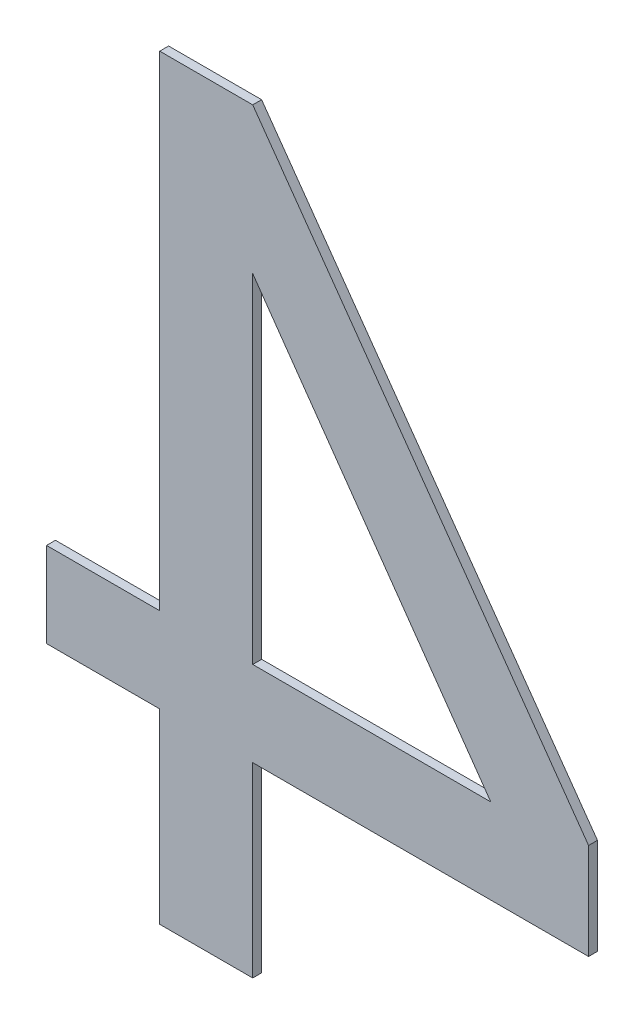
ISO-10303-21;
HEADER;
FILE_DESCRIPTION(('STEP AP214'),'2;1');
FILE_NAME('part.step','',(''),(''),'','','');
FILE_SCHEMA(('AUTOMOTIVE_DESIGN { 1 0 10303 214 1 1 1 1 }'));
ENDSEC;
DATA;
#1=APPLICATION_CONTEXT('core data for automotive mechanical design processes');
#2=APPLICATION_PROTOCOL_DEFINITION('international standard','automotive_design',2000,#1);
#3=PRODUCT_CONTEXT('',#1,'mechanical');
#4=PRODUCT('Part','Part','',(#3));
#5=PRODUCT_RELATED_PRODUCT_CATEGORY('part','',(#4));
#6=PRODUCT_DEFINITION_FORMATION('','',#4);
#7=PRODUCT_DEFINITION_CONTEXT('part definition',#1,'design');
#8=PRODUCT_DEFINITION('design','',#6,#7);
#9=PRODUCT_DEFINITION_SHAPE('','',#8);
#10=(LENGTH_UNIT() NAMED_UNIT(*) SI_UNIT(.MILLI.,.METRE.));
#11=(NAMED_UNIT(*) PLANE_ANGLE_UNIT() SI_UNIT($,.RADIAN.));
#12=(NAMED_UNIT(*) SI_UNIT($,.STERADIAN.) SOLID_ANGLE_UNIT());
#13=UNCERTAINTY_MEASURE_WITH_UNIT(LENGTH_MEASURE(1.E-05),#10,'distance_accuracy_value','');
#14=(GEOMETRIC_REPRESENTATION_CONTEXT(3) GLOBAL_UNCERTAINTY_ASSIGNED_CONTEXT((#13)) GLOBAL_UNIT_ASSIGNED_CONTEXT((#10,
#11,#12)) REPRESENTATION_CONTEXT('',''));
#15=CARTESIAN_POINT('',(0.,0.,0.));
#16=DIRECTION('',(0.,0.,1.));
#17=DIRECTION('',(1.,0.,0.));
#18=AXIS2_PLACEMENT_3D('',#15,#16,#17);
#19=CARTESIAN_POINT('',(0.459574876566214,1.8244100426255,-3.53695));
#20=DIRECTION('',(0.,0.,1.));
#21=DIRECTION('',(1.,0.,0.));
#22=AXIS2_PLACEMENT_3D('',#19,#20,#21);
#23=PLANE('',#22);
#24=DIRECTION('',(-0.57527075867692,0.817963051861929,0.));
#25=VECTOR('',#24,1.);
#26=CARTESIAN_POINT('',(0.49826978474495,1.86917473544442,-3.53695));
#27=LINE('',#26,#25);
#28=CARTESIAN_POINT('',(0.583246842571535,1.74834798993431,-3.53695));
#29=VERTEX_POINT('',#28);
#30=CARTESIAN_POINT('',(0.413292726918359,1.99000148095454,-3.53695));
#31=VERTEX_POINT('',#30);
#32=EDGE_CURVE('E176',#29,#31,#27,.T.);
#33=ORIENTED_EDGE('',*,*,#32,.T.);
#34=DIRECTION('',(0.,1.,0.));
#35=VECTOR('',#34,1.);
#36=CARTESIAN_POINT('',(0.413292726918354,1.86917473544442,-3.53695));
#37=LINE('',#36,#35);
#38=CARTESIAN_POINT('',(0.413292726918354,1.74834798993431,-3.53695));
#39=VERTEX_POINT('',#38);
#40=EDGE_CURVE('E184',#39,#31,#37,.T.);
#41=ORIENTED_EDGE('',*,*,#40,.F.);
#42=DIRECTION('',(1.,0.,0.));
#43=VECTOR('',#42,1.);
#44=CARTESIAN_POINT('',(0.49826978474495,1.74834798993431,-3.53695));
#45=LINE('',#44,#43);
#46=EDGE_CURVE('E181',#29,#39,#45,.F.);
#47=ORIENTED_EDGE('',*,*,#46,.F.);
#48=EDGE_LOOP('',(#33,#41,#47));
#49=FACE_BOUND('',#48,.T.);
#50=DIRECTION('',(1.,0.,0.));
#51=VECTOR('',#50,1.);
#52=CARTESIAN_POINT('',(0.533171073229762,1.68765009148682,-3.53695));
#53=LINE('',#52,#51);
#54=CARTESIAN_POINT('',(0.653049419540916,1.68765009148682,-3.53695));
#55=VERTEX_POINT('',#54);
#56=CARTESIAN_POINT('',(0.413292726918354,1.68765009148682,-3.53695));
#57=VERTEX_POINT('',#56);
#58=EDGE_CURVE('E161',#55,#57,#53,.F.);
#59=ORIENTED_EDGE('',*,*,#58,.T.);
#60=DIRECTION('',(0.,1.,0.));
#61=VECTOR('',#60,1.);
#62=CARTESIAN_POINT('',(0.413292726918354,1.62107208698955,-3.53695));
#63=LINE('',#62,#61);
#64=CARTESIAN_POINT('',(0.413292726918354,1.55449408249228,-3.53695));
#65=VERTEX_POINT('',#64);
#66=EDGE_CURVE('E158',#65,#57,#63,.T.);
#67=ORIENTED_EDGE('',*,*,#66,.F.);
#68=DIRECTION('',(1.,0.,0.));
#69=VECTOR('',#68,1.);
#70=CARTESIAN_POINT('',(0.380098562403844,1.55449408249228,-3.53695));
#71=LINE('',#70,#69);
#72=CARTESIAN_POINT('',(0.346904397889334,1.55449408249228,-3.53695));
#73=VERTEX_POINT('',#72);
#74=EDGE_CURVE('E151',#65,#73,#71,.F.);
#75=ORIENTED_EDGE('',*,*,#74,.T.);
#76=DIRECTION('',(0.,1.,0.));
#77=VECTOR('',#76,1.);
#78=CARTESIAN_POINT('',(0.346904397889334,1.62107208698955,-3.53695));
#79=LINE('',#78,#77);
#80=CARTESIAN_POINT('',(0.346904397889334,1.68765009148682,-3.53695));
#81=VERTEX_POINT('',#80);
#82=EDGE_CURVE('E147',#73,#81,#79,.T.);
#83=ORIENTED_EDGE('',*,*,#82,.T.);
#84=DIRECTION('',(1.,0.,0.));
#85=VECTOR('',#84,1.);
#86=CARTESIAN_POINT('',(0.306502365740296,1.68765009148682,-3.53695));
#87=LINE('',#86,#85);
#88=CARTESIAN_POINT('',(0.266100333591512,1.68765009148682,-3.53695));
#89=VERTEX_POINT('',#88);
#90=EDGE_CURVE('E143',#81,#89,#87,.F.);
#91=ORIENTED_EDGE('',*,*,#90,.T.);
#92=DIRECTION('',(0.,1.,0.));
#93=VECTOR('',#92,1.);
#94=CARTESIAN_POINT('',(0.266100333591512,1.71799904071057,-3.53695));
#95=LINE('',#94,#93);
#96=CARTESIAN_POINT('',(0.266100333591512,1.74834798993431,-3.53695));
#97=VERTEX_POINT('',#96);
#98=EDGE_CURVE('E139',#89,#97,#95,.T.);
#99=ORIENTED_EDGE('',*,*,#98,.T.);
#100=DIRECTION('',(1.,0.,0.));
#101=VECTOR('',#100,1.);
#102=CARTESIAN_POINT('',(0.306502365740296,1.74834798993431,-3.53695));
#103=LINE('',#102,#101);
#104=CARTESIAN_POINT('',(0.346904397889334,1.74834798993431,-3.53695));
#105=VERTEX_POINT('',#104);
#106=EDGE_CURVE('E121',#105,#97,#103,.F.);
#107=ORIENTED_EDGE('',*,*,#106,.F.);
#108=DIRECTION('',(0.,1.,0.));
#109=VECTOR('',#108,1.);
#110=CARTESIAN_POINT('',(0.346904397889334,1.92133699634626,-3.53695));
#111=LINE('',#110,#109);
#112=CARTESIAN_POINT('',(0.346904397889334,2.09432600275846,-3.53695));
#113=VERTEX_POINT('',#112);
#114=EDGE_CURVE('E114',#105,#113,#111,.T.);
#115=ORIENTED_EDGE('',*,*,#114,.T.);
#116=DIRECTION('',(1.,0.,0.));
#117=VECTOR('',#116,1.);
#118=CARTESIAN_POINT('',(0.380098562403844,2.09432600275846,-3.53695));
#119=LINE('',#118,#117);
#120=CARTESIAN_POINT('',(0.413292726918371,2.09432600275848,-3.53695));
#121=VERTEX_POINT('',#120);
#122=EDGE_CURVE('E19',#121,#113,#119,.F.);
#123=ORIENTED_EDGE('',*,*,#122,.F.);
#124=DIRECTION('',(-0.578550603330596,0.815646491677494,0.));
#125=VECTOR('',#124,1.);
#126=CARTESIAN_POINT('',(0.533171073229762,1.92532029775353,-3.53695));
#127=LINE('',#126,#125);
#128=CARTESIAN_POINT('',(0.653049419540941,1.75631459274862,-3.53695));
#129=VERTEX_POINT('',#128);
#130=EDGE_CURVE('E173',#129,#121,#127,.T.);
#131=ORIENTED_EDGE('',*,*,#130,.F.);
#132=DIRECTION('',(0.,1.,0.));
#133=VECTOR('',#132,1.);
#134=CARTESIAN_POINT('',(0.653049419540916,1.72198234211758,-3.53695));
#135=LINE('',#134,#133);
#136=EDGE_CURVE('E168',#55,#129,#135,.T.);
#137=ORIENTED_EDGE('',*,*,#136,.F.);
#138=EDGE_LOOP('',(#59,#67,#75,#83,#91,#99,#107,#115,#123,#131,#137));
#139=FACE_BOUND('',#138,.T.);
#140=ADVANCED_FACE('F16',(#49,#139),#23,.F.);
#141=CARTESIAN_POINT('',(0.380098562403844,2.09432600275846,-3.533775));
#142=DIRECTION('',(0.,1.,0.));
#143=DIRECTION('',(0.,0.,1.));
#144=AXIS2_PLACEMENT_3D('',#141,#142,#143);
#145=PLANE('',#144);
#146=DIRECTION('',(0.,0.,-1.));
#147=VECTOR('',#146,1.);
#148=CARTESIAN_POINT('',(0.346904397889334,2.09432600275846,-3.533775));
#149=LINE('',#148,#147);
#150=CARTESIAN_POINT('',(0.346904397889334,2.09432600275846,-3.5306));
#151=VERTEX_POINT('',#150);
#152=EDGE_CURVE('E123',#113,#151,#149,.F.);
#153=ORIENTED_EDGE('',*,*,#152,.T.);
#154=DIRECTION('',(1.,0.,0.));
#155=VECTOR('',#154,1.);
#156=CARTESIAN_POINT('',(0.459574876566214,2.09432600275846,-3.5306));
#157=LINE('',#156,#155);
#158=CARTESIAN_POINT('',(0.413292726918371,2.09432600275848,-3.5306));
#159=VERTEX_POINT('',#158);
#160=EDGE_CURVE('E190',#159,#151,#157,.F.);
#161=ORIENTED_EDGE('',*,*,#160,.F.);
#162=DIRECTION('',(0.,0.,1.));
#163=VECTOR('',#162,1.);
#164=CARTESIAN_POINT('',(0.413292726918422,2.09432600275851,-3.533775));
#165=LINE('',#164,#163);
#166=EDGE_CURVE('E128',#121,#159,#165,.T.);
#167=ORIENTED_EDGE('',*,*,#166,.F.);
#168=ORIENTED_EDGE('',*,*,#122,.T.);
#169=EDGE_LOOP('',(#153,#161,#167,#168));
#170=FACE_BOUND('',#169,.T.);
#171=ADVANCED_FACE('F125',(#170),#145,.T.);
#172=CARTESIAN_POINT('',(0.346904397889334,1.92133699634626,-3.533775));
#173=DIRECTION('',(1.,0.,0.));
#174=DIRECTION('',(0.,0.,-1.));
#175=AXIS2_PLACEMENT_3D('',#172,#173,#174);
#176=PLANE('',#175);
#177=ORIENTED_EDGE('',*,*,#114,.F.);
#178=DIRECTION('',(0.,0.,1.));
#179=VECTOR('',#178,1.);
#180=CARTESIAN_POINT('',(0.346904397889334,1.74834798993431,-3.533775));
#181=LINE('',#180,#179);
#182=CARTESIAN_POINT('',(0.346904397889334,1.74834798993431,-3.5306));
#183=VERTEX_POINT('',#182);
#184=EDGE_CURVE('E134',#183,#105,#181,.F.);
#185=ORIENTED_EDGE('',*,*,#184,.F.);
#186=DIRECTION('',(0.,1.,0.));
#187=VECTOR('',#186,1.);
#188=CARTESIAN_POINT('',(0.346904397889334,1.8244100426255,-3.5306));
#189=LINE('',#188,#187);
#190=EDGE_CURVE('E132',#151,#183,#189,.F.);
#191=ORIENTED_EDGE('',*,*,#190,.F.);
#192=ORIENTED_EDGE('',*,*,#152,.F.);
#193=EDGE_LOOP('',(#177,#185,#191,#192));
#194=FACE_BOUND('',#193,.T.);
#195=ADVANCED_FACE('F130',(#194),#176,.F.);
#196=CARTESIAN_POINT('',(0.306502365740296,1.74834798993431,-3.533775));
#197=DIRECTION('',(0.,1.,0.));
#198=DIRECTION('',(0.,0.,1.));
#199=AXIS2_PLACEMENT_3D('',#196,#197,#198);
#200=PLANE('',#199);
#201=DIRECTION('',(0.,0.,-1.));
#202=VECTOR('',#201,1.);
#203=CARTESIAN_POINT('',(0.266100333591512,1.74834798993431,-3.533775));
#204=LINE('',#203,#202);
#205=CARTESIAN_POINT('',(0.266100333591512,1.74834798993431,-3.5306));
#206=VERTEX_POINT('',#205);
#207=EDGE_CURVE('E141',#97,#206,#204,.F.);
#208=ORIENTED_EDGE('',*,*,#207,.T.);
#209=DIRECTION('',(1.,0.,0.));
#210=VECTOR('',#209,1.);
#211=CARTESIAN_POINT('',(0.459574876566214,1.74834798993431,-3.5306));
#212=LINE('',#211,#210);
#213=EDGE_CURVE('E193',#183,#206,#212,.F.);
#214=ORIENTED_EDGE('',*,*,#213,.F.);
#215=ORIENTED_EDGE('',*,*,#184,.T.);
#216=ORIENTED_EDGE('',*,*,#106,.T.);
#217=EDGE_LOOP('',(#208,#214,#215,#216));
#218=FACE_BOUND('',#217,.T.);
#219=ADVANCED_FACE('F279',(#218),#200,.T.);
#220=CARTESIAN_POINT('',(0.266100333591512,1.71799904071057,-3.533775));
#221=DIRECTION('',(1.,0.,0.));
#222=DIRECTION('',(0.,0.,-1.));
#223=AXIS2_PLACEMENT_3D('',#220,#221,#222);
#224=PLANE('',#223);
#225=ORIENTED_EDGE('',*,*,#98,.F.);
#226=DIRECTION('',(0.,0.,1.));
#227=VECTOR('',#226,1.);
#228=CARTESIAN_POINT('',(0.266100333591512,1.68765009148682,-3.533775));
#229=LINE('',#228,#227);
#230=CARTESIAN_POINT('',(0.266100333591512,1.68765009148682,-3.5306));
#231=VERTEX_POINT('',#230);
#232=EDGE_CURVE('E145',#89,#231,#229,.T.);
#233=ORIENTED_EDGE('',*,*,#232,.T.);
#234=DIRECTION('',(0.,1.,0.));
#235=VECTOR('',#234,1.);
#236=CARTESIAN_POINT('',(0.266100333591512,1.8244100426255,-3.5306));
#237=LINE('',#236,#235);
#238=EDGE_CURVE('E196',#206,#231,#237,.F.);
#239=ORIENTED_EDGE('',*,*,#238,.F.);
#240=ORIENTED_EDGE('',*,*,#207,.F.);
#241=EDGE_LOOP('',(#225,#233,#239,#240));
#242=FACE_BOUND('',#241,.T.);
#243=ADVANCED_FACE('F275',(#242),#224,.F.);
#244=CARTESIAN_POINT('',(0.306502365740296,1.68765009148682,-3.533775));
#245=DIRECTION('',(0.,1.,0.));
#246=DIRECTION('',(0.,0.,1.));
#247=AXIS2_PLACEMENT_3D('',#244,#245,#246);
#248=PLANE('',#247);
#249=ORIENTED_EDGE('',*,*,#90,.F.);
#250=DIRECTION('',(0.,0.,-1.));
#251=VECTOR('',#250,1.);
#252=CARTESIAN_POINT('',(0.346904397889334,1.68765009148682,-3.533775));
#253=LINE('',#252,#251);
#254=CARTESIAN_POINT('',(0.346904397889334,1.68765009148682,-3.5306));
#255=VERTEX_POINT('',#254);
#256=EDGE_CURVE('E149',#81,#255,#253,.F.);
#257=ORIENTED_EDGE('',*,*,#256,.T.);
#258=DIRECTION('',(1.,0.,0.));
#259=VECTOR('',#258,1.);
#260=CARTESIAN_POINT('',(0.459574876566214,1.68765009148682,-3.5306));
#261=LINE('',#260,#259);
#262=EDGE_CURVE('E199',#231,#255,#261,.T.);
#263=ORIENTED_EDGE('',*,*,#262,.F.);
#264=ORIENTED_EDGE('',*,*,#232,.F.);
#265=EDGE_LOOP('',(#249,#257,#263,#264));
#266=FACE_BOUND('',#265,.T.);
#267=ADVANCED_FACE('F271',(#266),#248,.F.);
#268=CARTESIAN_POINT('',(0.346904397889334,1.62107208698955,-3.533775));
#269=DIRECTION('',(1.,0.,0.));
#270=DIRECTION('',(0.,0.,-1.));
#271=AXIS2_PLACEMENT_3D('',#268,#269,#270);
#272=PLANE('',#271);
#273=ORIENTED_EDGE('',*,*,#82,.F.);
#274=DIRECTION('',(0.,0.,1.));
#275=VECTOR('',#274,1.);
#276=CARTESIAN_POINT('',(0.346904397889334,1.55449408249228,-3.533775));
#277=LINE('',#276,#275);
#278=CARTESIAN_POINT('',(0.346904397889334,1.55449408249228,-3.5306));
#279=VERTEX_POINT('',#278);
#280=EDGE_CURVE('E153',#73,#279,#277,.T.);
#281=ORIENTED_EDGE('',*,*,#280,.T.);
#282=DIRECTION('',(0.,1.,0.));
#283=VECTOR('',#282,1.);
#284=CARTESIAN_POINT('',(0.346904397889334,1.8244100426255,-3.5306));
#285=LINE('',#284,#283);
#286=EDGE_CURVE('E202',#255,#279,#285,.F.);
#287=ORIENTED_EDGE('',*,*,#286,.F.);
#288=ORIENTED_EDGE('',*,*,#256,.F.);
#289=EDGE_LOOP('',(#273,#281,#287,#288));
#290=FACE_BOUND('',#289,.T.);
#291=ADVANCED_FACE('F267',(#290),#272,.F.);
#292=CARTESIAN_POINT('',(0.380098562403844,1.55449408249228,-3.533775));
#293=DIRECTION('',(0.,1.,0.));
#294=DIRECTION('',(0.,0.,1.));
#295=AXIS2_PLACEMENT_3D('',#292,#293,#294);
#296=PLANE('',#295);
#297=ORIENTED_EDGE('',*,*,#74,.F.);
#298=DIRECTION('',(0.,0.,-1.));
#299=VECTOR('',#298,1.);
#300=CARTESIAN_POINT('',(0.413292726918354,1.55449408249228,-3.533775));
#301=LINE('',#300,#299);
#302=CARTESIAN_POINT('',(0.413292726918354,1.55449408249228,-3.5306));
#303=VERTEX_POINT('',#302);
#304=EDGE_CURVE('E155',#303,#65,#301,.T.);
#305=ORIENTED_EDGE('',*,*,#304,.F.);
#306=DIRECTION('',(1.,0.,0.));
#307=VECTOR('',#306,1.);
#308=CARTESIAN_POINT('',(0.459574876566214,1.55449408249228,-3.5306));
#309=LINE('',#308,#307);
#310=EDGE_CURVE('E205',#279,#303,#309,.T.);
#311=ORIENTED_EDGE('',*,*,#310,.F.);
#312=ORIENTED_EDGE('',*,*,#280,.F.);
#313=EDGE_LOOP('',(#297,#305,#311,#312));
#314=FACE_BOUND('',#313,.T.);
#315=ADVANCED_FACE('F263',(#314),#296,.F.);
#316=CARTESIAN_POINT('',(0.413292726918354,1.62107208698955,-3.533775));
#317=DIRECTION('',(1.,0.,0.));
#318=DIRECTION('',(0.,0.,-1.));
#319=AXIS2_PLACEMENT_3D('',#316,#317,#318);
#320=PLANE('',#319);
#321=DIRECTION('',(0.,0.,1.));
#322=VECTOR('',#321,1.);
#323=CARTESIAN_POINT('',(0.413292726918354,1.68765009148682,-3.533775));
#324=LINE('',#323,#322);
#325=CARTESIAN_POINT('',(0.413292726918354,1.68765009148682,-3.5306));
#326=VERTEX_POINT('',#325);
#327=EDGE_CURVE('E163',#57,#326,#324,.T.);
#328=ORIENTED_EDGE('',*,*,#327,.T.);
#329=DIRECTION('',(0.,1.,0.));
#330=VECTOR('',#329,1.);
#331=CARTESIAN_POINT('',(0.413292726918354,1.8244100426255,-3.5306));
#332=LINE('',#331,#330);
#333=EDGE_CURVE('E208',#303,#326,#332,.T.);
#334=ORIENTED_EDGE('',*,*,#333,.F.);
#335=ORIENTED_EDGE('',*,*,#304,.T.);
#336=ORIENTED_EDGE('',*,*,#66,.T.);
#337=EDGE_LOOP('',(#328,#334,#335,#336));
#338=FACE_BOUND('',#337,.T.);
#339=ADVANCED_FACE('F259',(#338),#320,.T.);
#340=CARTESIAN_POINT('',(0.533171073229762,1.68765009148682,-3.533775));
#341=DIRECTION('',(0.,1.,0.));
#342=DIRECTION('',(0.,0.,1.));
#343=AXIS2_PLACEMENT_3D('',#340,#341,#342);
#344=PLANE('',#343);
#345=ORIENTED_EDGE('',*,*,#58,.F.);
#346=DIRECTION('',(0.,0.,-1.));
#347=VECTOR('',#346,1.);
#348=CARTESIAN_POINT('',(0.653049419540916,1.68765009148682,-3.533775));
#349=LINE('',#348,#347);
#350=CARTESIAN_POINT('',(0.653049419540916,1.68765009148682,-3.5306));
#351=VERTEX_POINT('',#350);
#352=EDGE_CURVE('E165',#351,#55,#349,.T.);
#353=ORIENTED_EDGE('',*,*,#352,.F.);
#354=DIRECTION('',(1.,0.,0.));
#355=VECTOR('',#354,1.);
#356=CARTESIAN_POINT('',(0.459574876566214,1.68765009148682,-3.5306));
#357=LINE('',#356,#355);
#358=EDGE_CURVE('E211',#326,#351,#357,.T.);
#359=ORIENTED_EDGE('',*,*,#358,.F.);
#360=ORIENTED_EDGE('',*,*,#327,.F.);
#361=EDGE_LOOP('',(#345,#353,#359,#360));
#362=FACE_BOUND('',#361,.T.);
#363=ADVANCED_FACE('F255',(#362),#344,.F.);
#364=CARTESIAN_POINT('',(0.653049419540916,1.72198234211758,-3.533775));
#365=DIRECTION('',(1.,0.,0.));
#366=DIRECTION('',(0.,0.,-1.));
#367=AXIS2_PLACEMENT_3D('',#364,#365,#366);
#368=PLANE('',#367);
#369=DIRECTION('',(0.,0.,1.));
#370=VECTOR('',#369,1.);
#371=CARTESIAN_POINT('',(0.653049419541017,1.75631459274867,-3.533775));
#372=LINE('',#371,#370);
#373=CARTESIAN_POINT('',(0.653049419540941,1.75631459274862,-3.5306));
#374=VERTEX_POINT('',#373);
#375=EDGE_CURVE('E170',#374,#129,#372,.F.);
#376=ORIENTED_EDGE('',*,*,#375,.F.);
#377=DIRECTION('',(0.,1.,0.));
#378=VECTOR('',#377,1.);
#379=CARTESIAN_POINT('',(0.653049419540916,1.8244100426255,-3.5306));
#380=LINE('',#379,#378);
#381=EDGE_CURVE('E214',#351,#374,#380,.T.);
#382=ORIENTED_EDGE('',*,*,#381,.F.);
#383=ORIENTED_EDGE('',*,*,#352,.T.);
#384=ORIENTED_EDGE('',*,*,#136,.T.);
#385=EDGE_LOOP('',(#376,#382,#383,#384));
#386=FACE_BOUND('',#385,.T.);
#387=ADVANCED_FACE('F251',(#386),#368,.T.);
#388=CARTESIAN_POINT('',(0.533171073229762,1.92532029775353,-3.533775));
#389=DIRECTION('',(0.815646491677494,0.578550603330596,0.));
#390=DIRECTION('',(-0.578550603330596,0.815646491677494,0.));
#391=AXIS2_PLACEMENT_3D('',#388,#389,#390);
#392=PLANE('',#391);
#393=ORIENTED_EDGE('',*,*,#166,.T.);
#394=DIRECTION('',(-0.578550603330517,0.81564649167755,0.));
#395=VECTOR('',#394,1.);
#396=CARTESIAN_POINT('',(0.653049419540916,1.7563145927486,-3.5306));
#397=LINE('',#396,#395);
#398=EDGE_CURVE('E217',#374,#159,#397,.T.);
#399=ORIENTED_EDGE('',*,*,#398,.F.);
#400=ORIENTED_EDGE('',*,*,#375,.T.);
#401=ORIENTED_EDGE('',*,*,#130,.T.);
#402=EDGE_LOOP('',(#393,#399,#400,#401));
#403=FACE_BOUND('',#402,.T.);
#404=ADVANCED_FACE('F248',(#403),#392,.T.);
#405=CARTESIAN_POINT('',(0.49826978474495,1.86917473544442,-3.533775));
#406=DIRECTION('',(0.817963051861929,0.57527075867692,0.));
#407=DIRECTION('',(-0.57527075867692,0.817963051861929,0.));
#408=AXIS2_PLACEMENT_3D('',#405,#406,#407);
#409=PLANE('',#408);
#410=ORIENTED_EDGE('',*,*,#32,.F.);
#411=DIRECTION('',(0.,0.,1.));
#412=VECTOR('',#411,1.);
#413=CARTESIAN_POINT('',(0.583246842571546,1.74834798993431,-3.533775));
#414=LINE('',#413,#412);
#415=CARTESIAN_POINT('',(0.583246842571535,1.74834798993431,-3.5306));
#416=VERTEX_POINT('',#415);
#417=EDGE_CURVE('E178',#416,#29,#414,.F.);
#418=ORIENTED_EDGE('',*,*,#417,.F.);
#419=DIRECTION('',(0.575270758677063,-0.817963051861828,0.));
#420=VECTOR('',#419,1.);
#421=CARTESIAN_POINT('',(0.413292726918354,1.99000148095453,-3.5306));
#422=LINE('',#421,#420);
#423=CARTESIAN_POINT('',(0.413292726918365,1.99000148095454,-3.5306));
#424=VERTEX_POINT('',#423);
#425=EDGE_CURVE('E220',#424,#416,#422,.T.);
#426=ORIENTED_EDGE('',*,*,#425,.F.);
#427=DIRECTION('',(0.,0.,-1.));
#428=VECTOR('',#427,1.);
#429=CARTESIAN_POINT('',(0.413292726918354,1.99000148095453,-3.533775));
#430=LINE('',#429,#428);
#431=EDGE_CURVE('E187',#31,#424,#430,.F.);
#432=ORIENTED_EDGE('',*,*,#431,.F.);
#433=EDGE_LOOP('',(#410,#418,#426,#432));
#434=FACE_BOUND('',#433,.T.);
#435=ADVANCED_FACE('F231',(#434),#409,.F.);
#436=CARTESIAN_POINT('',(0.49826978474495,1.74834798993431,-3.533775));
#437=DIRECTION('',(0.,1.,0.));
#438=DIRECTION('',(0.,0.,1.));
#439=AXIS2_PLACEMENT_3D('',#436,#437,#438);
#440=PLANE('',#439);
#441=DIRECTION('',(0.,0.,-1.));
#442=VECTOR('',#441,1.);
#443=CARTESIAN_POINT('',(0.413292726918354,1.74834798993431,-3.533775));
#444=LINE('',#443,#442);
#445=CARTESIAN_POINT('',(0.413292726918354,1.74834798993431,-3.5306));
#446=VERTEX_POINT('',#445);
#447=EDGE_CURVE('E34',#446,#39,#444,.T.);
#448=ORIENTED_EDGE('',*,*,#447,.F.);
#449=DIRECTION('',(1.,0.,0.));
#450=VECTOR('',#449,1.);
#451=CARTESIAN_POINT('',(0.459574876566214,1.74834798993431,-3.5306));
#452=LINE('',#451,#450);
#453=EDGE_CURVE('E25',#416,#446,#452,.F.);
#454=ORIENTED_EDGE('',*,*,#453,.F.);
#455=ORIENTED_EDGE('',*,*,#417,.T.);
#456=ORIENTED_EDGE('',*,*,#46,.T.);
#457=EDGE_LOOP('',(#448,#454,#455,#456));
#458=FACE_BOUND('',#457,.T.);
#459=ADVANCED_FACE('F227',(#458),#440,.T.);
#460=CARTESIAN_POINT('',(0.413292726918354,1.86917473544442,-3.533775));
#461=DIRECTION('',(1.,0.,0.));
#462=DIRECTION('',(0.,0.,-1.));
#463=AXIS2_PLACEMENT_3D('',#460,#461,#462);
#464=PLANE('',#463);
#465=ORIENTED_EDGE('',*,*,#431,.T.);
#466=DIRECTION('',(0.,1.,0.));
#467=VECTOR('',#466,1.);
#468=CARTESIAN_POINT('',(0.413292726918354,1.8244100426255,-3.5306));
#469=LINE('',#468,#467);
#470=EDGE_CURVE('E11',#446,#424,#469,.T.);
#471=ORIENTED_EDGE('',*,*,#470,.F.);
#472=ORIENTED_EDGE('',*,*,#447,.T.);
#473=ORIENTED_EDGE('',*,*,#40,.T.);
#474=EDGE_LOOP('',(#465,#471,#472,#473));
#475=FACE_BOUND('',#474,.T.);
#476=ADVANCED_FACE('F235',(#475),#464,.T.);
#477=CARTESIAN_POINT('',(0.459574876566214,1.8244100426255,-3.5306));
#478=DIRECTION('',(0.,0.,1.));
#479=DIRECTION('',(1.,0.,0.));
#480=AXIS2_PLACEMENT_3D('',#477,#478,#479);
#481=PLANE('',#480);
#482=ORIENTED_EDGE('',*,*,#453,.T.);
#483=ORIENTED_EDGE('',*,*,#470,.T.);
#484=ORIENTED_EDGE('',*,*,#425,.T.);
#485=EDGE_LOOP('',(#482,#483,#484));
#486=FACE_BOUND('',#485,.T.);
#487=ORIENTED_EDGE('',*,*,#381,.T.);
#488=ORIENTED_EDGE('',*,*,#398,.T.);
#489=ORIENTED_EDGE('',*,*,#160,.T.);
#490=ORIENTED_EDGE('',*,*,#190,.T.);
#491=ORIENTED_EDGE('',*,*,#213,.T.);
#492=ORIENTED_EDGE('',*,*,#238,.T.);
#493=ORIENTED_EDGE('',*,*,#262,.T.);
#494=ORIENTED_EDGE('',*,*,#286,.T.);
#495=ORIENTED_EDGE('',*,*,#310,.T.);
#496=ORIENTED_EDGE('',*,*,#333,.T.);
#497=ORIENTED_EDGE('',*,*,#358,.T.);
#498=EDGE_LOOP('',(#487,#488,#489,#490,#491,#492,#493,#494,#495,#496,#497));
#499=FACE_BOUND('',#498,.T.);
#500=ADVANCED_FACE('F225',(#486,#499),#481,.T.);
#501=CLOSED_SHELL('',(#140,#171,#195,#219,#243,#267,#291,#315,#339,#363,#387,#404,#435,#459,
#476,#500));
#502=MANIFOLD_SOLID_BREP('B1',#501);
#503=ADVANCED_BREP_SHAPE_REPRESENTATION('',(#18,#502),#14);
#504=SHAPE_DEFINITION_REPRESENTATION(#9,#503);
ENDSEC;
END-ISO-10303-21;
